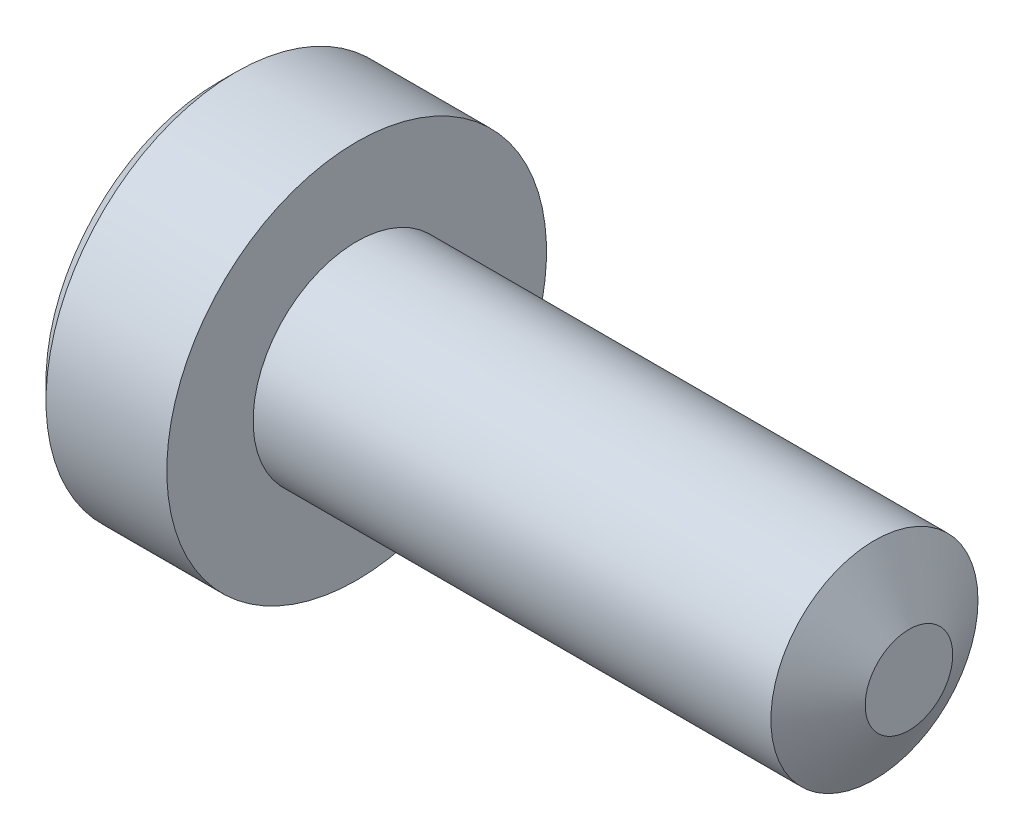
ISO-10303-21;
HEADER;
FILE_DESCRIPTION(('STEP AP214'),'2;1');
FILE_NAME('part.step','',(''),(''),'','','');
FILE_SCHEMA(('AUTOMOTIVE_DESIGN { 1 0 10303 214 1 1 1 1 }'));
ENDSEC;
DATA;
#1=APPLICATION_CONTEXT('core data for automotive mechanical design processes');
#2=APPLICATION_PROTOCOL_DEFINITION('international standard','automotive_design',2000,#1);
#3=PRODUCT_CONTEXT('',#1,'mechanical');
#4=PRODUCT('Part','Part','',(#3));
#5=PRODUCT_RELATED_PRODUCT_CATEGORY('part','',(#4));
#6=PRODUCT_DEFINITION_FORMATION('','',#4);
#7=PRODUCT_DEFINITION_CONTEXT('part definition',#1,'design');
#8=PRODUCT_DEFINITION('design','',#6,#7);
#9=PRODUCT_DEFINITION_SHAPE('','',#8);
#10=(LENGTH_UNIT() NAMED_UNIT(*) SI_UNIT(.MILLI.,.METRE.));
#11=(NAMED_UNIT(*) PLANE_ANGLE_UNIT() SI_UNIT($,.RADIAN.));
#12=(NAMED_UNIT(*) SI_UNIT($,.STERADIAN.) SOLID_ANGLE_UNIT());
#13=UNCERTAINTY_MEASURE_WITH_UNIT(LENGTH_MEASURE(1.E-05),#10,'distance_accuracy_value','');
#14=(GEOMETRIC_REPRESENTATION_CONTEXT(3) GLOBAL_UNCERTAINTY_ASSIGNED_CONTEXT((#13)) GLOBAL_UNIT_ASSIGNED_CONTEXT((#10,
#11,#12)) REPRESENTATION_CONTEXT('',''));
#15=CARTESIAN_POINT('',(0.,0.,0.));
#16=DIRECTION('',(0.,0.,1.));
#17=DIRECTION('',(1.,0.,0.));
#18=AXIS2_PLACEMENT_3D('',#15,#16,#17);
#19=CARTESIAN_POINT('',(-6.,2.5,0.));
#20=DIRECTION('',(-1.,0.,0.));
#21=DIRECTION('',(0.,-1.,0.));
#22=AXIS2_PLACEMENT_3D('',#19,#20,#21);
#23=PLANE('',#22);
#24=CARTESIAN_POINT('',(-6.,0.,0.));
#25=DIRECTION('',(-1.,0.,0.));
#26=DIRECTION('',(0.,-1.,0.));
#27=AXIS2_PLACEMENT_3D('',#24,#25,#26);
#28=CIRCLE('',#27,1.1547005383792);
#29=CARTESIAN_POINT('',(-6.00000000000001,-1.15470053837917,-1.39319979164387E-13));
#30=VERTEX_POINT('',#29);
#31=CARTESIAN_POINT('',(-6.,-0.577350269189691,0.999999999999887));
#32=VERTEX_POINT('',#31);
#33=EDGE_CURVE('E141',#30,#32,#28,.T.);
#34=ORIENTED_EDGE('',*,*,#33,.F.);
#35=CARTESIAN_POINT('',(-6.,-0.577350269189626,-1.));
#36=VERTEX_POINT('',#35);
#37=EDGE_CURVE('E138',#36,#30,#28,.T.);
#38=ORIENTED_EDGE('',*,*,#37,.F.);
#39=CARTESIAN_POINT('',(-6.,0.577350269189557,-0.999999999999999));
#40=VERTEX_POINT('',#39);
#41=EDGE_CURVE('E102',#40,#36,#28,.T.);
#42=ORIENTED_EDGE('',*,*,#41,.F.);
#43=CARTESIAN_POINT('',(-6.,1.15470053837923,0.));
#44=VERTEX_POINT('',#43);
#45=EDGE_CURVE('E93',#44,#40,#28,.T.);
#46=ORIENTED_EDGE('',*,*,#45,.F.);
#47=CARTESIAN_POINT('',(-6.,0.577350269189557,1.));
#48=VERTEX_POINT('',#47);
#49=EDGE_CURVE('E54',#48,#44,#28,.T.);
#50=ORIENTED_EDGE('',*,*,#49,.F.);
#51=EDGE_CURVE('E61',#32,#48,#28,.T.);
#52=ORIENTED_EDGE('',*,*,#51,.F.);
#53=EDGE_LOOP('',(#34,#38,#42,#46,#50,#52));
#54=FACE_BOUND('',#53,.T.);
#55=CARTESIAN_POINT('',(-6.,0.,0.));
#56=DIRECTION('',(1.,0.,0.));
#57=DIRECTION('',(0.,1.,0.));
#58=AXIS2_PLACEMENT_3D('',#55,#56,#57);
#59=CIRCLE('',#58,2.5);
#60=CARTESIAN_POINT('',(-6.,2.5,0.));
#61=VERTEX_POINT('',#60);
#62=EDGE_CURVE('E236',#61,#61,#59,.T.);
#63=ORIENTED_EDGE('',*,*,#62,.F.);
#64=EDGE_LOOP('',(#63));
#65=FACE_BOUND('',#64,.T.);
#66=ADVANCED_FACE('F39',(#54,#65),#23,.T.);
#67=CARTESIAN_POINT('',(-4.,0.,0.));
#68=DIRECTION('',(1.,0.,0.));
#69=DIRECTION('',(0.,0.,-1.));
#70=AXIS2_PLACEMENT_3D('',#67,#68,#69);
#71=CYLINDRICAL_SURFACE('',#70,1.5);
#72=CARTESIAN_POINT('',(3.5,0.,0.));
#73=DIRECTION('',(1.,0.,0.));
#74=DIRECTION('',(0.,0.,-1.));
#75=AXIS2_PLACEMENT_3D('',#72,#73,#74);
#76=CIRCLE('',#75,1.5);
#77=CARTESIAN_POINT('',(3.5,0.,-1.5));
#78=VERTEX_POINT('',#77);
#79=EDGE_CURVE('E11',#78,#78,#76,.F.);
#80=ORIENTED_EDGE('',*,*,#79,.T.);
#81=EDGE_LOOP('',(#80));
#82=FACE_BOUND('',#81,.T.);
#83=CARTESIAN_POINT('',(-4.,0.,0.));
#84=DIRECTION('',(1.,0.,0.));
#85=DIRECTION('',(0.,0.,-1.));
#86=AXIS2_PLACEMENT_3D('',#83,#84,#85);
#87=CIRCLE('',#86,1.5);
#88=CARTESIAN_POINT('',(-4.,0.,-1.5));
#89=VERTEX_POINT('',#88);
#90=EDGE_CURVE('E114',#89,#89,#87,.T.);
#91=ORIENTED_EDGE('',*,*,#90,.T.);
#92=EDGE_LOOP('',(#91));
#93=FACE_BOUND('',#92,.T.);
#94=ADVANCED_FACE('F214',(#82,#93),#71,.T.);
#95=CARTESIAN_POINT('',(-4.,0.,0.));
#96=DIRECTION('',(1.,0.,0.));
#97=DIRECTION('',(0.,1.,0.));
#98=AXIS2_PLACEMENT_3D('',#95,#96,#97);
#99=CYLINDRICAL_SURFACE('',#98,2.75);
#100=CARTESIAN_POINT('',(-5.75,0.,0.));
#101=DIRECTION('',(1.,0.,0.));
#102=DIRECTION('',(0.,1.,0.));
#103=AXIS2_PLACEMENT_3D('',#100,#101,#102);
#104=CIRCLE('',#103,2.75);
#105=CARTESIAN_POINT('',(-5.75,2.75,0.));
#106=VERTEX_POINT('',#105);
#107=EDGE_CURVE('E233',#106,#106,#104,.T.);
#108=ORIENTED_EDGE('',*,*,#107,.T.);
#109=EDGE_LOOP('',(#108));
#110=FACE_BOUND('',#109,.T.);
#111=CARTESIAN_POINT('',(-4.00000000000001,0.,0.));
#112=DIRECTION('',(1.,0.,0.));
#113=DIRECTION('',(0.,1.,0.));
#114=AXIS2_PLACEMENT_3D('',#111,#112,#113);
#115=CIRCLE('',#114,2.75);
#116=CARTESIAN_POINT('',(-4.,2.75,0.));
#117=VERTEX_POINT('',#116);
#118=EDGE_CURVE('E242',#117,#117,#115,.T.);
#119=ORIENTED_EDGE('',*,*,#118,.F.);
#120=EDGE_LOOP('',(#119));
#121=FACE_BOUND('',#120,.T.);
#122=ADVANCED_FACE('F217',(#110,#121),#99,.T.);
#123=CARTESIAN_POINT('',(-5.75,0.,0.));
#124=DIRECTION('',(1.,0.,0.));
#125=DIRECTION('',(0.,1.,0.));
#126=AXIS2_PLACEMENT_3D('',#123,#124,#125);
#127=CONICAL_SURFACE('',#126,2.75,0.785398163397448);
#128=ORIENTED_EDGE('',*,*,#62,.T.);
#129=EDGE_LOOP('',(#128));
#130=FACE_BOUND('',#129,.T.);
#131=ORIENTED_EDGE('',*,*,#107,.F.);
#132=EDGE_LOOP('',(#131));
#133=FACE_BOUND('',#132,.T.);
#134=ADVANCED_FACE('F210',(#130,#133),#127,.T.);
#135=CARTESIAN_POINT('',(-4.,2.75,0.));
#136=DIRECTION('',(1.,0.,0.));
#137=DIRECTION('',(0.,1.,0.));
#138=AXIS2_PLACEMENT_3D('',#135,#136,#137);
#139=PLANE('',#138);
#140=ORIENTED_EDGE('',*,*,#90,.F.);
#141=EDGE_LOOP('',(#140));
#142=FACE_BOUND('',#141,.T.);
#143=ORIENTED_EDGE('',*,*,#118,.T.);
#144=EDGE_LOOP('',(#143));
#145=FACE_BOUND('',#144,.T.);
#146=ADVANCED_FACE('F167',(#142,#145),#139,.T.);
#147=CARTESIAN_POINT('',(-6.,0.,0.));
#148=DIRECTION('',(-1.,0.,0.));
#149=DIRECTION('',(0.,-1.,0.));
#150=AXIS2_PLACEMENT_3D('',#147,#148,#149);
#151=CONICAL_SURFACE('',#150,1.1547005383792,0.78539816339745);
#152=CARTESIAN_POINT('',(-6.37038567764042,-1.15147208663214,-1.));
#153=CARTESIAN_POINT('',(-6.3492199199954,-1.12343448004834,-1.));
#154=CARTESIAN_POINT('',(-6.32826169229273,-1.09524064866508,-1.));
#155=CARTESIAN_POINT('',(-6.28684602234274,-1.03847715659239,-1.));
#156=CARTESIAN_POINT('',(-6.26638870622594,-1.00990740397361,-1.));
#157=CARTESIAN_POINT('',(-6.20560479504219,-0.92312089446276,-1.));
#158=CARTESIAN_POINT('',(-6.16619222903939,-0.864253173878428,-1.));
#159=CARTESIAN_POINT('',(-6.08882066425825,-0.740809858355793,-1.));
#160=CARTESIAN_POINT('',(-6.05107303916222,-0.67610025522379,-1.));
#161=CARTESIAN_POINT('',(-5.98202458758031,-0.543448939110577,-1.));
#162=CARTESIAN_POINT('',(-5.95070202786719,-0.475519112076474,-1.));
#163=CARTESIAN_POINT('',(-5.91238177889766,-0.373555850372626,-1.));
#164=CARTESIAN_POINT('',(-5.90138359165627,-0.341031989714023,-1.));
#165=CARTESIAN_POINT('',(-5.88199834216116,-0.275199079103579,-1.));
#166=CARTESIAN_POINT('',(-5.87361145978994,-0.241889975229369,-0.999999999999999));
#167=CARTESIAN_POINT('',(-5.86002522073019,-0.175247517106591,-0.999999999999999));
#168=CARTESIAN_POINT('',(-5.85477079077767,-0.141925568285784,-0.999999999999999));
#169=CARTESIAN_POINT('',(-5.84754868657673,-0.0749144363077763,-0.999999999999999));
#170=CARTESIAN_POINT('',(-5.84558151361396,-0.0412251979295377,-0.999999999999999));
#171=CARTESIAN_POINT('',(-5.84508319839116,0.0249580991768899,-0.999999999999999));
#172=CARTESIAN_POINT('',(-5.84643026788362,0.0574512825562216,-0.999999999999999));
#173=CARTESIAN_POINT('',(-5.85221648448747,0.122148505605805,-0.999999999999999));
#174=CARTESIAN_POINT('',(-5.85665492064654,0.154352610033907,-0.999999999999999));
#175=CARTESIAN_POINT('',(-5.8684568301229,0.218799898762781,-0.999999999999999));
#176=CARTESIAN_POINT('',(-5.87587054101236,0.251033743161223,-0.999999999999999));
#177=CARTESIAN_POINT('',(-5.89322894246476,0.314797132241721,-0.999999999999999));
#178=CARTESIAN_POINT('',(-5.90317342125099,0.346326735615211,-0.999999999999999));
#179=CARTESIAN_POINT('',(-5.93822348249799,0.445594187589192,-0.999999999999999));
#180=CARTESIAN_POINT('',(-5.96732085828335,0.511919139313662,-0.999999999999999));
#181=CARTESIAN_POINT('',(-6.03201532957719,0.641453244454075,-0.999999999999999));
#182=CARTESIAN_POINT('',(-6.06763577658701,0.704650132903177,-0.999999999999999));
#183=CARTESIAN_POINT('',(-6.14112390118249,0.825428489916382,-0.999999999999999));
#184=CARTESIAN_POINT('',(-6.1787919469539,0.883132947593227,-0.999999999999999));
#185=CARTESIAN_POINT('',(-6.23702285273599,0.968148853406666,-0.999999999999999));
#186=CARTESIAN_POINT('',(-6.25663847554722,0.996120570074685,-0.999999999999999));
#187=CARTESIAN_POINT('',(-6.29638851682872,1.05168177697806,-0.999999999999999));
#188=CARTESIAN_POINT('',(-6.31652279195782,1.0792713696484,-0.999999999999999));
#189=CARTESIAN_POINT('',(-6.33687211882352,1.10670185312705,-0.999999999999999));
#190=B_SPLINE_CURVE_WITH_KNOTS('',3,(#152,#153,#154,#155,#156,#157,#158,#159,#160,#161,#162,
#163,#164,#165,#166,#167,#168,#169,#170,#171,#172,#173,#174,#175,#176,#177,#178,#179,#180,#181,
#182,#183,#184,#185,#186,#187,#188,#189),.UNSPECIFIED.,.F.,.F.,(4,2,2,2,2,2,2,2,2,2,2,2,2,2,2,2,
2,2,4),(0.,0.105386459103352,0.210799187370253,0.42323361164648,0.647793541035362,
0.87158087791088,0.97449307434207,1.07741235842106,1.17846428216997,1.27953161428441,
1.37694086751271,1.47432772596049,1.57343322813837,1.67253043981298,1.88917353997388,
2.10660791031435,2.31323734235674,2.41572589214525,2.51818641455634),.UNSPECIFIED.);
#191=EDGE_CURVE('E107',#36,#40,#190,.T.);
#192=ORIENTED_EDGE('',*,*,#191,.T.);
#193=ORIENTED_EDGE('',*,*,#41,.T.);
#194=EDGE_LOOP('',(#192,#193));
#195=FACE_BOUND('',#194,.T.);
#196=ADVANCED_FACE('F108',(#195),#151,.F.);
#197=CARTESIAN_POINT('',(-6.0001154873727,-1.15481600843309,0.000200000000000293));
#198=CARTESIAN_POINT('',(-5.98027793082582,-1.13496520795026,-0.0341825950071812));
#199=CARTESIAN_POINT('',(-5.96160502063897,-1.11478247255942,-0.0691401181398262));
#200=CARTESIAN_POINT('',(-5.92741474272324,-1.07362739529219,-0.140422802956093));
#201=CARTESIAN_POINT('',(-5.91191640902354,-1.0526511355808,-0.176754750528988));
#202=CARTESIAN_POINT('',(-5.88536730714235,-1.01035337909803,-0.250016613803317));
#203=CARTESIAN_POINT('',(-5.87424977399701,-0.989042666109237,-0.286927851445421));
#204=CARTESIAN_POINT('',(-5.85711986577626,-0.945952199282686,-0.361562729310868));
#205=CARTESIAN_POINT('',(-5.85109469746675,-0.924173762626591,-0.399284088108645));
#206=CARTESIAN_POINT('',(-5.84566055496757,-0.886641312640008,-0.464292198417944));
#207=CARTESIAN_POINT('',(-5.84485693831681,-0.870936130672269,-0.491494371528184));
#208=CARTESIAN_POINT('',(-5.84620669941697,-0.839556179862841,-0.545846040669125));
#209=CARTESIAN_POINT('',(-5.84836072954728,-0.823881418494916,-0.572995523754889));
#210=CARTESIAN_POINT('',(-5.85911697212855,-0.777080970599358,-0.654056277326975));
#211=CARTESIAN_POINT('',(-5.87201455641544,-0.746188191116421,-0.707564140978444));
#212=CARTESIAN_POINT('',(-5.90314073060226,-0.691968116419641,-0.801476065143446));
#213=CARTESIAN_POINT('',(-5.91973779770192,-0.668386557293365,-0.842320523671846));
#214=CARTESIAN_POINT('',(-5.95712492468537,-0.622147085933678,-0.922409637381949));
#215=CARTESIAN_POINT('',(-5.97790134181747,-0.599486449584574,-0.96165901087044));
#216=CARTESIAN_POINT('',(-6.00011548737268,-0.577234799135788,-1.0002));
#217=B_SPLINE_CURVE_WITH_KNOTS('',3,(#197,#198,#199,#200,#201,#202,#203,#204,#205,#206,#207,
#208,#209,#210,#211,#212,#213,#214,#215,#216),.UNSPECIFIED.,.F.,.F.,(4,2,2,2,2,2,2,2,2,4),(0.,
0.133237676828562,0.267252229834497,0.39913707626931,0.530689603280781,0.624814864263861,
0.71896089014915,0.907306626112119,1.0571010036179,1.20641411519286),.UNSPECIFIED.);
#218=EDGE_CURVE('E144',#30,#36,#217,.T.);
#219=ORIENTED_EDGE('',*,*,#218,.T.);
#220=ORIENTED_EDGE('',*,*,#37,.T.);
#221=EDGE_LOOP('',(#219,#220));
#222=FACE_BOUND('',#221,.T.);
#223=ADVANCED_FACE('F166',(#222),#151,.F.);
#224=CARTESIAN_POINT('',(-6.00011548737268,-0.577234799135788,1.0002));
#225=CARTESIAN_POINT('',(-5.9802779308258,-0.597085599618621,0.965817404992819));
#226=CARTESIAN_POINT('',(-5.96160502063896,-0.617268335009456,0.930859881860176));
#227=CARTESIAN_POINT('',(-5.92741474272323,-0.658423412276684,0.859577197043913));
#228=CARTESIAN_POINT('',(-5.91191640902353,-0.679399671988078,0.823245249471019));
#229=CARTESIAN_POINT('',(-5.88536730714234,-0.721697428470843,0.749983386196694));
#230=CARTESIAN_POINT('',(-5.874249773997,-0.743008141459633,0.713072148554592));
#231=CARTESIAN_POINT('',(-5.85711986577626,-0.786098608286181,0.638437270689149));
#232=CARTESIAN_POINT('',(-5.85109469746675,-0.807877044942276,0.600715911891374));
#233=CARTESIAN_POINT('',(-5.84566055496757,-0.845409494928857,0.535707801582077));
#234=CARTESIAN_POINT('',(-5.84485693831681,-0.861114676896596,0.508505628471837));
#235=CARTESIAN_POINT('',(-5.84620669941697,-0.892494627706024,0.454153959330896));
#236=CARTESIAN_POINT('',(-5.84836072954728,-0.908169389073949,0.427004476245132));
#237=CARTESIAN_POINT('',(-5.85911697212855,-0.954969836969507,0.345943722673046));
#238=CARTESIAN_POINT('',(-5.87201455641544,-0.985862616452444,0.292435859021578));
#239=CARTESIAN_POINT('',(-5.90314073060226,-1.04008269114923,0.198523934856572));
#240=CARTESIAN_POINT('',(-5.91973779770192,-1.0636642502755,0.157679476328168));
#241=CARTESIAN_POINT('',(-5.95712492468538,-1.1099037216352,0.0775903626180576));
#242=CARTESIAN_POINT('',(-5.97790134181749,-1.1325643579843,0.038340989129563));
#243=CARTESIAN_POINT('',(-6.0001154873727,-1.15481600843309,-0.000199999999999653));
#244=B_SPLINE_CURVE_WITH_KNOTS('',3,(#224,#225,#226,#227,#228,#229,#230,#231,#232,#233,#234,
#235,#236,#237,#238,#239,#240,#241,#242,#243),.UNSPECIFIED.,.F.,.F.,(4,2,2,2,2,2,2,2,2,4),(0.,
0.133237676828555,0.267252229834482,0.399137076269288,0.530689603280752,0.624814864263832,
0.718960890149121,0.907306626112089,1.05710100361789,1.20641411519286),.UNSPECIFIED.);
#245=EDGE_CURVE('E153',#32,#30,#244,.T.);
#246=ORIENTED_EDGE('',*,*,#245,.T.);
#247=ORIENTED_EDGE('',*,*,#33,.T.);
#248=EDGE_LOOP('',(#246,#247));
#249=FACE_BOUND('',#248,.T.);
#250=ADVANCED_FACE('F289',(#249),#151,.F.);
#251=CARTESIAN_POINT('',(-6.37038567751393,-1.1514720864646,1.));
#252=CARTESIAN_POINT('',(-6.34921991987378,-1.1234344798855,1.));
#253=CARTESIAN_POINT('',(-6.32826169217598,-1.09524064850696,1.));
#254=CARTESIAN_POINT('',(-6.28684602223569,-1.03847715644375,1.));
#255=CARTESIAN_POINT('',(-6.26638870612372,-1.00990740382973,1.));
#256=CARTESIAN_POINT('',(-6.20560479495457,-0.923120894333461,1.));
#257=CARTESIAN_POINT('',(-6.16619222896146,-0.864253173759043,1.));
#258=CARTESIAN_POINT('',(-6.08882066420026,-0.740809858258027,1.));
#259=CARTESIAN_POINT('',(-6.0510730391144,-0.676100255137788,1.));
#260=CARTESIAN_POINT('',(-5.98202458755135,-0.543448939049103,1.));
#261=CARTESIAN_POINT('',(-5.95070202784692,-0.475519112027757,1.));
#262=CARTESIAN_POINT('',(-5.91238177888385,-0.373555850333506,1.));
#263=CARTESIAN_POINT('',(-5.90138359164221,-0.341031989670885,1.));
#264=CARTESIAN_POINT('',(-5.88199834214741,-0.27519907905227,1.));
#265=CARTESIAN_POINT('',(-5.87361145977675,-0.241889975173909,1.));
#266=CARTESIAN_POINT('',(-5.86002522071907,-0.175247517042968,1.));
#267=CARTESIAN_POINT('',(-5.85477079076802,-0.14192556821815,1.));
#268=CARTESIAN_POINT('',(-5.84754868657094,-0.0749144362322539,1.));
#269=CARTESIAN_POINT('',(-5.84558151361056,-0.0412251978501365,1.));
#270=CARTESIAN_POINT('',(-5.84508319839321,0.0249580992634466,1.));
#271=CARTESIAN_POINT('',(-5.84643026788869,0.0574512826460652,1.));
#272=CARTESIAN_POINT('',(-5.85221648449903,0.122148505701893,1.));
#273=CARTESIAN_POINT('',(-5.85665492066158,0.154352610132953,1.));
#274=CARTESIAN_POINT('',(-5.86845683014525,0.218799898867667,1.));
#275=CARTESIAN_POINT('',(-5.87587054103856,0.251033743268981,1.));
#276=CARTESIAN_POINT('',(-5.89322894249872,0.314797132354947,1.));
#277=CARTESIAN_POINT('',(-5.90317342128888,0.346326735731033,1.));
#278=CARTESIAN_POINT('',(-5.93822348255439,0.445594187730233,1.));
#279=CARTESIAN_POINT('',(-5.96732085835677,0.511919139476065,1.));
#280=CARTESIAN_POINT('',(-6.03201532968655,0.64145324465756,1.));
#281=CARTESIAN_POINT('',(-6.06763577671529,0.704650133126372,1.));
#282=CARTESIAN_POINT('',(-6.14112390134698,0.825428490175014,1.));
#283=CARTESIAN_POINT('',(-6.17879194713551,0.883132947867712,1.));
#284=CARTESIAN_POINT('',(-6.23702285294321,0.968148853704593,1.));
#285=CARTESIAN_POINT('',(-6.2566384757629,0.996120570380313,1.));
#286=CARTESIAN_POINT('',(-6.29638851706132,1.05168177729904,1.));
#287=CARTESIAN_POINT('',(-6.31652279219888,1.07927136997703,1.));
#288=CARTESIAN_POINT('',(-6.33687211907302,1.10670185346332,1.));
#289=B_SPLINE_CURVE_WITH_KNOTS('',3,(#251,#252,#253,#254,#255,#256,#257,#258,#259,#260,#261,
#262,#263,#264,#265,#266,#267,#268,#269,#270,#271,#272,#273,#274,#275,#276,#277,#278,#279,#280,
#281,#282,#283,#284,#285,#286,#287,#288),.UNSPECIFIED.,.F.,.F.,(4,2,2,2,2,2,2,2,2,2,2,2,2,2,2,2,
2,2,4),(0.,0.105386459083292,0.210799187330127,0.423233611565475,0.647793540908514,
0.871580877738624,0.974493074181436,1.07741235827203,1.17846428203206,1.27953161415764,
1.37694086739612,1.4743277258541,1.57343322804295,1.67253043972853,1.88917353996829,
2.10660791038815,2.31323734249845,2.41572589232046,2.51818641476505),.UNSPECIFIED.);
#290=EDGE_CURVE('E179',#48,#32,#289,.F.);
#291=ORIENTED_EDGE('',*,*,#290,.T.);
#292=ORIENTED_EDGE('',*,*,#51,.T.);
#293=EDGE_LOOP('',(#291,#292));
#294=FACE_BOUND('',#293,.T.);
#295=ADVANCED_FACE('F307',(#294),#151,.F.);
#296=CARTESIAN_POINT('',(-6.00011548737263,1.15481600843309,-0.000199999999999946));
#297=CARTESIAN_POINT('',(-5.98027793082575,1.13496520795026,0.0341825950071801));
#298=CARTESIAN_POINT('',(-5.96160502063891,1.11478247255942,0.0691401181398235));
#299=CARTESIAN_POINT('',(-5.92741474272318,1.07362739529219,0.140422802956087));
#300=CARTESIAN_POINT('',(-5.91191640902348,1.0526511355808,0.17675475052898));
#301=CARTESIAN_POINT('',(-5.88536730714229,1.01035337909804,0.250016613803305));
#302=CARTESIAN_POINT('',(-5.87424977399695,0.989042666109245,0.286927851445408));
#303=CARTESIAN_POINT('',(-5.85711986577621,0.945952199282697,0.361562729310851));
#304=CARTESIAN_POINT('',(-5.8510946974667,0.924173762626603,0.399284088108626));
#305=CARTESIAN_POINT('',(-5.84566055496752,0.886641312640022,0.464292198417923));
#306=CARTESIAN_POINT('',(-5.84485693831676,0.870936130672283,0.491494371528161));
#307=CARTESIAN_POINT('',(-5.84620669941691,0.839556179862857,0.545846040669099));
#308=CARTESIAN_POINT('',(-5.84836072954722,0.823881418494932,0.572995523754862));
#309=CARTESIAN_POINT('',(-5.8591169721285,0.777080970599376,0.654056277326945));
#310=CARTESIAN_POINT('',(-5.87201455641538,0.746188191116441,0.707564140978411));
#311=CARTESIAN_POINT('',(-5.9031407306022,0.691968116419659,0.801476065143417));
#312=CARTESIAN_POINT('',(-5.91973779770187,0.668386557293379,0.842320523671823));
#313=CARTESIAN_POINT('',(-5.95712492468532,0.622147085933686,0.922409637381938));
#314=CARTESIAN_POINT('',(-5.97790134181744,0.599486449584578,0.961659010870435));
#315=CARTESIAN_POINT('',(-6.00011548737265,0.577234799135789,1.0002));
#316=B_SPLINE_CURVE_WITH_KNOTS('',3,(#296,#297,#298,#299,#300,#301,#302,#303,#304,#305,#306,
#307,#308,#309,#310,#311,#312,#313,#314,#315),.UNSPECIFIED.,.F.,.F.,(4,2,2,2,2,2,2,2,2,4),(0.,
0.133237676828556,0.267252229834484,0.399137076269291,0.530689603280755,0.624814864263831,
0.718960890149116,0.907306626112076,1.05710100361788,1.20641411519286),.UNSPECIFIED.);
#317=EDGE_CURVE('E127',#44,#48,#316,.T.);
#318=ORIENTED_EDGE('',*,*,#317,.T.);
#319=ORIENTED_EDGE('',*,*,#49,.T.);
#320=EDGE_LOOP('',(#318,#319));
#321=FACE_BOUND('',#320,.T.);
#322=ADVANCED_FACE('F279',(#321),#151,.F.);
#323=CARTESIAN_POINT('',(-6.00011548737265,0.577234799135789,-1.0002));
#324=CARTESIAN_POINT('',(-5.98027793082577,0.597085599618623,-0.965817404992818));
#325=CARTESIAN_POINT('',(-5.96160502063892,0.617268335009458,-0.930859881860173));
#326=CARTESIAN_POINT('',(-5.92741474272319,0.658423412276689,-0.859577197043907));
#327=CARTESIAN_POINT('',(-5.91191640902349,0.679399671988083,-0.823245249471012));
#328=CARTESIAN_POINT('',(-5.88536730714229,0.72169742847085,-0.749983386196683));
#329=CARTESIAN_POINT('',(-5.87424977399695,0.743008141459641,-0.713072148554579));
#330=CARTESIAN_POINT('',(-5.85711986577621,0.786098608286192,-0.638437270689132));
#331=CARTESIAN_POINT('',(-5.8510946974667,0.807877044942287,-0.600715911891355));
#332=CARTESIAN_POINT('',(-5.84566055496752,0.845409494928869,-0.535707801582057));
#333=CARTESIAN_POINT('',(-5.84485693831676,0.861114676896608,-0.508505628471819));
#334=CARTESIAN_POINT('',(-5.84620669941691,0.892494627706034,-0.45415395933088));
#335=CARTESIAN_POINT('',(-5.84836072954722,0.908169389073959,-0.427004476245117));
#336=CARTESIAN_POINT('',(-5.85911697212849,0.954969836969515,-0.345943722673034));
#337=CARTESIAN_POINT('',(-5.87201455641538,0.985862616452451,-0.292435859021567));
#338=CARTESIAN_POINT('',(-5.9031407306022,1.04008269114923,-0.198523934856565));
#339=CARTESIAN_POINT('',(-5.91973779770186,1.06366425027551,-0.157679476328163));
#340=CARTESIAN_POINT('',(-5.95712492468531,1.1099037216352,-0.0775903626180548));
#341=CARTESIAN_POINT('',(-5.97790134181742,1.1325643579843,-0.0383409891295614));
#342=CARTESIAN_POINT('',(-6.00011548737263,1.15481600843309,0.000200000000000178));
#343=B_SPLINE_CURVE_WITH_KNOTS('',3,(#323,#324,#325,#326,#327,#328,#329,#330,#331,#332,#333,
#334,#335,#336,#337,#338,#339,#340,#341,#342),.UNSPECIFIED.,.F.,.F.,(4,2,2,2,2,2,2,2,2,4),(0.,
0.133237676828562,0.267252229834497,0.39913707626931,0.530689603280782,0.624814864263858,
0.718960890149143,0.907306626112104,1.0571010036179,1.20641411519286),.UNSPECIFIED.);
#344=EDGE_CURVE('E97',#40,#44,#343,.T.);
#345=ORIENTED_EDGE('',*,*,#344,.T.);
#346=ORIENTED_EDGE('',*,*,#45,.T.);
#347=EDGE_LOOP('',(#345,#346));
#348=FACE_BOUND('',#347,.T.);
#349=ADVANCED_FACE('F95',(#348),#151,.F.);
#350=CARTESIAN_POINT('',(-4.38,1.15470053837925,0.));
#351=DIRECTION('',(1.,0.,0.));
#352=DIRECTION('',(0.,0.,-1.));
#353=AXIS2_PLACEMENT_3D('',#350,#351,#352);
#354=PLANE('',#353);
#355=DIRECTION('',(0.,0.5,0.866025403784439));
#356=VECTOR('',#355,1.);
#357=CARTESIAN_POINT('',(-4.38,0.577350269189627,-0.999999999999999));
#358=LINE('',#357,#356);
#359=CARTESIAN_POINT('',(-4.38,0.577350269189627,-0.999999999999999));
#360=VERTEX_POINT('',#359);
#361=CARTESIAN_POINT('',(-4.38,1.15470053837925,0.));
#362=VERTEX_POINT('',#361);
#363=EDGE_CURVE('E126',#360,#362,#358,.T.);
#364=ORIENTED_EDGE('',*,*,#363,.F.);
#365=DIRECTION('',(0.,1.,0.));
#366=VECTOR('',#365,1.);
#367=CARTESIAN_POINT('',(-4.38,-0.577350269189626,-1.));
#368=LINE('',#367,#366);
#369=CARTESIAN_POINT('',(-4.38,-0.577350269189626,-1.));
#370=VERTEX_POINT('',#369);
#371=EDGE_CURVE('E131',#370,#360,#368,.T.);
#372=ORIENTED_EDGE('',*,*,#371,.F.);
#373=DIRECTION('',(0.,0.5,-0.866025403784439));
#374=VECTOR('',#373,1.);
#375=CARTESIAN_POINT('',(-4.38,-1.15470053837925,0.));
#376=LINE('',#375,#374);
#377=CARTESIAN_POINT('',(-4.38,-1.15470053837925,0.));
#378=VERTEX_POINT('',#377);
#379=EDGE_CURVE('E264',#378,#370,#376,.T.);
#380=ORIENTED_EDGE('',*,*,#379,.F.);
#381=DIRECTION('',(0.,-0.5,-0.866025403784439));
#382=VECTOR('',#381,1.);
#383=CARTESIAN_POINT('',(-4.38,-0.577350269189626,1.));
#384=LINE('',#383,#382);
#385=CARTESIAN_POINT('',(-4.38,-0.577350269189626,1.));
#386=VERTEX_POINT('',#385);
#387=EDGE_CURVE('E267',#386,#378,#384,.T.);
#388=ORIENTED_EDGE('',*,*,#387,.F.);
#389=DIRECTION('',(0.,-1.,0.));
#390=VECTOR('',#389,1.);
#391=CARTESIAN_POINT('',(-4.38,0.577350269189627,1.));
#392=LINE('',#391,#390);
#393=CARTESIAN_POINT('',(-4.38,0.577350269189627,1.));
#394=VERTEX_POINT('',#393);
#395=EDGE_CURVE('E270',#394,#386,#392,.T.);
#396=ORIENTED_EDGE('',*,*,#395,.F.);
#397=DIRECTION('',(0.,-0.5,0.866025403784439));
#398=VECTOR('',#397,1.);
#399=CARTESIAN_POINT('',(-4.38,1.15470053837925,0.));
#400=LINE('',#399,#398);
#401=EDGE_CURVE('E273',#362,#394,#400,.T.);
#402=ORIENTED_EDGE('',*,*,#401,.F.);
#403=EDGE_LOOP('',(#364,#372,#380,#388,#396,#402));
#404=FACE_BOUND('',#403,.T.);
#405=ADVANCED_FACE('F168',(#404),#354,.F.);
#406=CARTESIAN_POINT('',(-4.38,-0.577350269189626,-1.));
#407=DIRECTION('',(0.,0.,1.));
#408=DIRECTION('',(0.,-1.,0.));
#409=AXIS2_PLACEMENT_3D('',#406,#407,#408);
#410=PLANE('',#409);
#411=ORIENTED_EDGE('',*,*,#191,.F.);
#412=DIRECTION('',(-1.,0.,0.));
#413=VECTOR('',#412,1.);
#414=CARTESIAN_POINT('',(-4.38,-0.577350269189626,-1.));
#415=LINE('',#414,#413);
#416=EDGE_CURVE('E133',#370,#36,#415,.T.);
#417=ORIENTED_EDGE('',*,*,#416,.F.);
#418=ORIENTED_EDGE('',*,*,#371,.T.);
#419=DIRECTION('',(-1.,0.,0.));
#420=VECTOR('',#419,1.);
#421=CARTESIAN_POINT('',(-4.38,0.577350269189627,-0.999999999999999));
#422=LINE('',#421,#420);
#423=EDGE_CURVE('E121',#360,#40,#422,.T.);
#424=ORIENTED_EDGE('',*,*,#423,.T.);
#425=EDGE_LOOP('',(#411,#417,#418,#424));
#426=FACE_BOUND('',#425,.T.);
#427=ADVANCED_FACE('F129',(#426),#410,.T.);
#428=CARTESIAN_POINT('',(-4.38,-1.15470053837925,0.));
#429=DIRECTION('',(0.,0.866025403784439,0.5));
#430=DIRECTION('',(0.,-0.5,0.866025403784439));
#431=AXIS2_PLACEMENT_3D('',#428,#429,#430);
#432=PLANE('',#431);
#433=ORIENTED_EDGE('',*,*,#218,.F.);
#434=DIRECTION('',(-1.,0.,0.));
#435=VECTOR('',#434,1.);
#436=CARTESIAN_POINT('',(-4.38,-1.15470053837925,0.));
#437=LINE('',#436,#435);
#438=EDGE_CURVE('E256',#378,#30,#437,.T.);
#439=ORIENTED_EDGE('',*,*,#438,.F.);
#440=ORIENTED_EDGE('',*,*,#379,.T.);
#441=ORIENTED_EDGE('',*,*,#416,.T.);
#442=EDGE_LOOP('',(#433,#439,#440,#441));
#443=FACE_BOUND('',#442,.T.);
#444=ADVANCED_FACE('F160',(#443),#432,.T.);
#445=CARTESIAN_POINT('',(-4.38,-0.577350269189626,1.));
#446=DIRECTION('',(0.,0.866025403784438,-0.5));
#447=DIRECTION('',(0.,0.5,0.866025403784439));
#448=AXIS2_PLACEMENT_3D('',#445,#446,#447);
#449=PLANE('',#448);
#450=ORIENTED_EDGE('',*,*,#245,.F.);
#451=DIRECTION('',(-1.,0.,0.));
#452=VECTOR('',#451,1.);
#453=CARTESIAN_POINT('',(-4.38,-0.577350269189626,1.));
#454=LINE('',#453,#452);
#455=EDGE_CURVE('E252',#386,#32,#454,.T.);
#456=ORIENTED_EDGE('',*,*,#455,.F.);
#457=ORIENTED_EDGE('',*,*,#387,.T.);
#458=ORIENTED_EDGE('',*,*,#438,.T.);
#459=EDGE_LOOP('',(#450,#456,#457,#458));
#460=FACE_BOUND('',#459,.T.);
#461=ADVANCED_FACE('F295',(#460),#449,.T.);
#462=CARTESIAN_POINT('',(-4.38,0.577350269189627,1.));
#463=DIRECTION('',(0.,0.,-1.));
#464=DIRECTION('',(-1.,0.,0.));
#465=AXIS2_PLACEMENT_3D('',#462,#463,#464);
#466=PLANE('',#465);
#467=ORIENTED_EDGE('',*,*,#290,.F.);
#468=DIRECTION('',(-1.,0.,0.));
#469=VECTOR('',#468,1.);
#470=CARTESIAN_POINT('',(-4.38,0.577350269189627,1.));
#471=LINE('',#470,#469);
#472=EDGE_CURVE('E248',#394,#48,#471,.T.);
#473=ORIENTED_EDGE('',*,*,#472,.F.);
#474=ORIENTED_EDGE('',*,*,#395,.T.);
#475=ORIENTED_EDGE('',*,*,#455,.T.);
#476=EDGE_LOOP('',(#467,#473,#474,#475));
#477=FACE_BOUND('',#476,.T.);
#478=ADVANCED_FACE('F201',(#477),#466,.T.);
#479=CARTESIAN_POINT('',(-4.38,1.15470053837925,0.));
#480=DIRECTION('',(0.,-0.866025403784439,-0.5));
#481=DIRECTION('',(0.,0.5,-0.866025403784439));
#482=AXIS2_PLACEMENT_3D('',#479,#480,#481);
#483=PLANE('',#482);
#484=ORIENTED_EDGE('',*,*,#317,.F.);
#485=DIRECTION('',(-1.,0.,0.));
#486=VECTOR('',#485,1.);
#487=CARTESIAN_POINT('',(-4.38,1.15470053837925,0.));
#488=LINE('',#487,#486);
#489=EDGE_CURVE('E124',#362,#44,#488,.T.);
#490=ORIENTED_EDGE('',*,*,#489,.F.);
#491=ORIENTED_EDGE('',*,*,#401,.T.);
#492=ORIENTED_EDGE('',*,*,#472,.T.);
#493=EDGE_LOOP('',(#484,#490,#491,#492));
#494=FACE_BOUND('',#493,.T.);
#495=ADVANCED_FACE('F198',(#494),#483,.T.);
#496=CARTESIAN_POINT('',(-4.38,0.577350269189627,-0.999999999999999));
#497=DIRECTION('',(0.,-0.866025403784439,0.5));
#498=DIRECTION('',(0.,-0.5,-0.866025403784439));
#499=AXIS2_PLACEMENT_3D('',#496,#497,#498);
#500=PLANE('',#499);
#501=ORIENTED_EDGE('',*,*,#344,.F.);
#502=ORIENTED_EDGE('',*,*,#423,.F.);
#503=ORIENTED_EDGE('',*,*,#363,.T.);
#504=ORIENTED_EDGE('',*,*,#489,.T.);
#505=EDGE_LOOP('',(#501,#502,#503,#504));
#506=FACE_BOUND('',#505,.T.);
#507=ADVANCED_FACE('F119',(#506),#500,.T.);
#508=CARTESIAN_POINT('',(4.,0.,0.));
#509=DIRECTION('',(1.,0.,0.));
#510=DIRECTION('',(0.,0.,-1.));
#511=AXIS2_PLACEMENT_3D('',#508,#509,#510);
#512=PLANE('',#511);
#513=CARTESIAN_POINT('',(4.,0.,0.));
#514=DIRECTION('',(1.,0.,0.));
#515=DIRECTION('',(0.,0.,-1.));
#516=AXIS2_PLACEMENT_3D('',#513,#514,#515);
#517=CIRCLE('',#516,0.633974596215562);
#518=CARTESIAN_POINT('',(4.,0.,-0.633974596215562));
#519=VERTEX_POINT('',#518);
#520=EDGE_CURVE('E48',#519,#519,#517,.T.);
#521=ORIENTED_EDGE('',*,*,#520,.T.);
#522=EDGE_LOOP('',(#521));
#523=FACE_BOUND('',#522,.T.);
#524=ADVANCED_FACE('F207',(#523),#512,.T.);
#525=CARTESIAN_POINT('',(4.,0.,0.));
#526=DIRECTION('',(-1.,0.,0.));
#527=DIRECTION('',(0.,0.,1.));
#528=AXIS2_PLACEMENT_3D('',#525,#526,#527);
#529=CONICAL_SURFACE('',#528,0.633974596215562,1.0471975511966);
#530=ORIENTED_EDGE('',*,*,#79,.F.);
#531=EDGE_LOOP('',(#530));
#532=FACE_BOUND('',#531,.T.);
#533=ORIENTED_EDGE('',*,*,#520,.F.);
#534=EDGE_LOOP('',(#533));
#535=FACE_BOUND('',#534,.T.);
#536=ADVANCED_FACE('F41',(#532,#535),#529,.T.);
#537=CLOSED_SHELL('',(#66,#94,#122,#134,#146,#196,#223,#250,#295,#322,#349,#405,#427,#444,#461,
#478,#495,#507,#524,#536));
#538=MANIFOLD_SOLID_BREP('B2',#537);
#539=ADVANCED_BREP_SHAPE_REPRESENTATION('',(#18,#538),#14);
#540=SHAPE_DEFINITION_REPRESENTATION(#9,#539);
ENDSEC;
END-ISO-10303-21;
